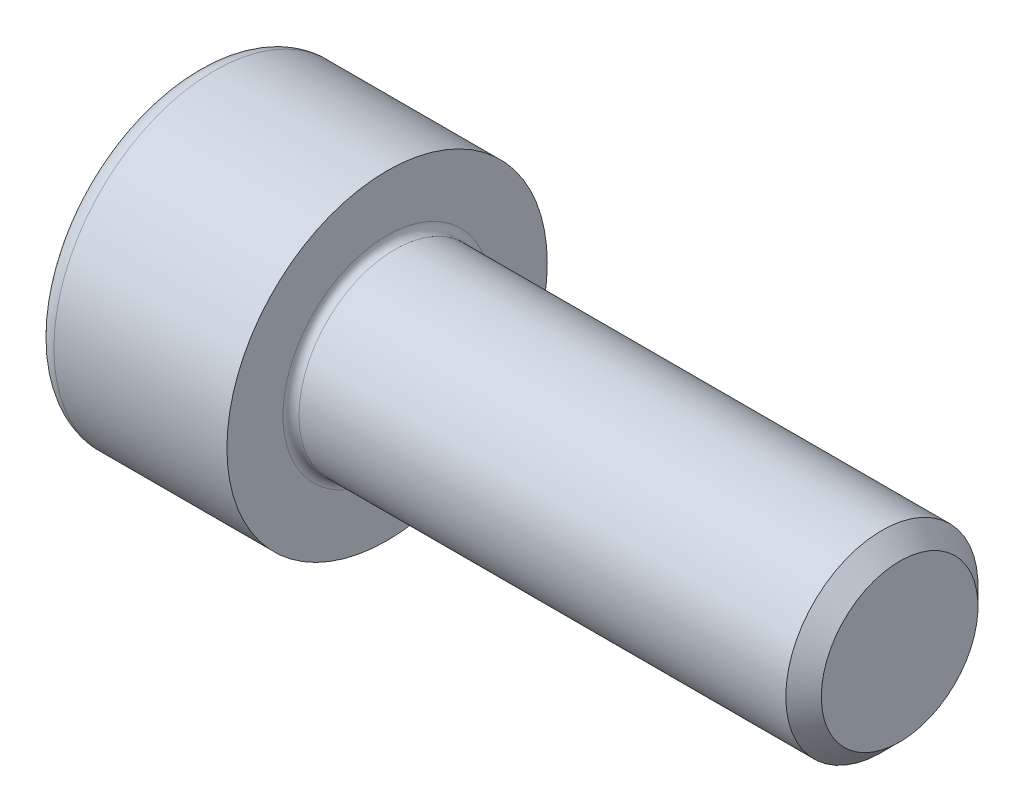
ISO-10303-21;
HEADER;
FILE_DESCRIPTION(('STEP AP214'),'2;1');
FILE_NAME('part.step','',(''),(''),'','','');
FILE_SCHEMA(('AUTOMOTIVE_DESIGN { 1 0 10303 214 1 1 1 1 }'));
ENDSEC;
DATA;
#1=APPLICATION_CONTEXT('core data for automotive mechanical design processes');
#2=APPLICATION_PROTOCOL_DEFINITION('international standard','automotive_design',2000,#1);
#3=PRODUCT_CONTEXT('',#1,'mechanical');
#4=PRODUCT('Part','Part','',(#3));
#5=PRODUCT_RELATED_PRODUCT_CATEGORY('part','',(#4));
#6=PRODUCT_DEFINITION_FORMATION('','',#4);
#7=PRODUCT_DEFINITION_CONTEXT('part definition',#1,'design');
#8=PRODUCT_DEFINITION('design','',#6,#7);
#9=PRODUCT_DEFINITION_SHAPE('','',#8);
#10=(LENGTH_UNIT() NAMED_UNIT(*) SI_UNIT(.MILLI.,.METRE.));
#11=(NAMED_UNIT(*) PLANE_ANGLE_UNIT() SI_UNIT($,.RADIAN.));
#12=(NAMED_UNIT(*) SI_UNIT($,.STERADIAN.) SOLID_ANGLE_UNIT());
#13=UNCERTAINTY_MEASURE_WITH_UNIT(LENGTH_MEASURE(1.E-05),#10,'distance_accuracy_value','');
#14=(GEOMETRIC_REPRESENTATION_CONTEXT(3) GLOBAL_UNCERTAINTY_ASSIGNED_CONTEXT((#13)) GLOBAL_UNIT_ASSIGNED_CONTEXT((#10,
#11,#12)) REPRESENTATION_CONTEXT('',''));
#15=CARTESIAN_POINT('',(0.,0.,0.));
#16=DIRECTION('',(0.,0.,1.));
#17=DIRECTION('',(1.,0.,0.));
#18=AXIS2_PLACEMENT_3D('',#15,#16,#17);
#19=CARTESIAN_POINT('',(0.,0.,0.));
#20=DIRECTION('',(-1.,0.,0.));
#21=DIRECTION('',(0.,0.,1.));
#22=AXIS2_PLACEMENT_3D('',#19,#20,#21);
#23=PLANE('',#22);
#24=DIRECTION('',(0.,-0.499999999999999,0.86602540378444));
#25=VECTOR('',#24,1.);
#26=CARTESIAN_POINT('',(0.,2.89829835133191,0.));
#27=LINE('',#26,#25);
#28=CARTESIAN_POINT('',(0.,2.89829835133191,0.));
#29=VERTEX_POINT('',#28);
#30=CARTESIAN_POINT('',(0.,1.44914917566596,2.51));
#31=VERTEX_POINT('',#30);
#32=EDGE_CURVE('E263',#29,#31,#27,.T.);
#33=ORIENTED_EDGE('',*,*,#32,.T.);
#34=DIRECTION('',(0.,1.,0.));
#35=VECTOR('',#34,1.);
#36=CARTESIAN_POINT('',(0.,-1.44914917566596,2.51));
#37=LINE('',#36,#35);
#38=CARTESIAN_POINT('',(0.,-1.44914917566596,2.51));
#39=VERTEX_POINT('',#38);
#40=EDGE_CURVE('E135',#39,#31,#37,.T.);
#41=ORIENTED_EDGE('',*,*,#40,.F.);
#42=DIRECTION('',(0.,-0.500000000000001,-0.866025403784438));
#43=VECTOR('',#42,1.);
#44=CARTESIAN_POINT('',(0.,-1.44914917566596,2.51));
#45=LINE('',#44,#43);
#46=CARTESIAN_POINT('',(0.,-2.89829835133192,0.));
#47=VERTEX_POINT('',#46);
#48=EDGE_CURVE('E266',#39,#47,#45,.T.);
#49=ORIENTED_EDGE('',*,*,#48,.T.);
#50=DIRECTION('',(0.,0.499999999999998,-0.866025403784439));
#51=VECTOR('',#50,1.);
#52=CARTESIAN_POINT('',(0.,-2.89829835133192,0.));
#53=LINE('',#52,#51);
#54=CARTESIAN_POINT('',(0.,-1.44914917566597,-2.51));
#55=VERTEX_POINT('',#54);
#56=EDGE_CURVE('E269',#47,#55,#53,.T.);
#57=ORIENTED_EDGE('',*,*,#56,.T.);
#58=DIRECTION('',(0.,-1.,0.));
#59=VECTOR('',#58,1.);
#60=CARTESIAN_POINT('',(0.,1.44914917566595,-2.51));
#61=LINE('',#60,#59);
#62=CARTESIAN_POINT('',(0.,1.44914917566595,-2.51));
#63=VERTEX_POINT('',#62);
#64=EDGE_CURVE('E272',#63,#55,#61,.T.);
#65=ORIENTED_EDGE('',*,*,#64,.F.);
#66=DIRECTION('',(0.,-0.500000000000001,-0.866025403784438));
#67=VECTOR('',#66,1.);
#68=CARTESIAN_POINT('',(0.,2.89829835133191,0.));
#69=LINE('',#68,#67);
#70=EDGE_CURVE('E130',#29,#63,#69,.T.);
#71=ORIENTED_EDGE('',*,*,#70,.F.);
#72=EDGE_LOOP('',(#33,#41,#49,#57,#65,#71));
#73=FACE_BOUND('',#72,.T.);
#74=CARTESIAN_POINT('',(0.,0.,0.));
#75=DIRECTION('',(-1.,0.,0.));
#76=DIRECTION('',(0.,0.,1.));
#77=AXIS2_PLACEMENT_3D('',#74,#75,#76);
#78=CIRCLE('',#77,4.4);
#79=CARTESIAN_POINT('',(0.,0.,4.4));
#80=VERTEX_POINT('',#79);
#81=EDGE_CURVE('E47',#80,#80,#78,.T.);
#82=ORIENTED_EDGE('',*,*,#81,.T.);
#83=EDGE_LOOP('',(#82));
#84=FACE_BOUND('',#83,.T.);
#85=ADVANCED_FACE('F39',(#73,#84),#23,.T.);
#86=CARTESIAN_POINT('',(-31.75,0.,0.));
#87=DIRECTION('',(-1.,0.,0.));
#88=DIRECTION('',(0.,0.,1.));
#89=AXIS2_PLACEMENT_3D('',#86,#87,#88);
#90=CYLINDRICAL_SURFACE('',#89,5.);
#91=CARTESIAN_POINT('',(0.600000000000003,0.,0.));
#92=DIRECTION('',(-1.,0.,0.));
#93=DIRECTION('',(0.,0.,1.));
#94=AXIS2_PLACEMENT_3D('',#91,#92,#93);
#95=CIRCLE('',#94,5.);
#96=CARTESIAN_POINT('',(0.600000000000003,0.,5.));
#97=VERTEX_POINT('',#96);
#98=EDGE_CURVE('E11',#97,#97,#95,.F.);
#99=ORIENTED_EDGE('',*,*,#98,.T.);
#100=EDGE_LOOP('',(#99));
#101=FACE_BOUND('',#100,.T.);
#102=CARTESIAN_POINT('',(6.,0.,0.));
#103=DIRECTION('',(-1.,0.,0.));
#104=DIRECTION('',(0.,0.,1.));
#105=AXIS2_PLACEMENT_3D('',#102,#103,#104);
#106=CIRCLE('',#105,5.);
#107=CARTESIAN_POINT('',(6.,0.,5.));
#108=VERTEX_POINT('',#107);
#109=EDGE_CURVE('E153',#108,#108,#106,.T.);
#110=ORIENTED_EDGE('',*,*,#109,.T.);
#111=EDGE_LOOP('',(#110));
#112=FACE_BOUND('',#111,.T.);
#113=ADVANCED_FACE('F177',(#101,#112),#90,.T.);
#114=CARTESIAN_POINT('',(6.,5.,0.));
#115=DIRECTION('',(1.,0.,0.));
#116=DIRECTION('',(0.,0.,-1.));
#117=AXIS2_PLACEMENT_3D('',#114,#115,#116);
#118=PLANE('',#117);
#119=CARTESIAN_POINT('',(6.,0.,0.));
#120=DIRECTION('',(1.,0.,0.));
#121=DIRECTION('',(0.,0.,-1.));
#122=AXIS2_PLACEMENT_3D('',#119,#120,#121);
#123=CIRCLE('',#122,3.24999999999999);
#124=CARTESIAN_POINT('',(6.,0.,-3.24999999999999));
#125=VERTEX_POINT('',#124);
#126=EDGE_CURVE('E156',#125,#125,#123,.F.);
#127=ORIENTED_EDGE('',*,*,#126,.T.);
#128=EDGE_LOOP('',(#127));
#129=FACE_BOUND('',#128,.T.);
#130=ORIENTED_EDGE('',*,*,#109,.F.);
#131=EDGE_LOOP('',(#130));
#132=FACE_BOUND('',#131,.T.);
#133=ADVANCED_FACE('F183',(#129,#132),#118,.T.);
#134=CARTESIAN_POINT('',(-31.75,0.,0.));
#135=DIRECTION('',(-1.,0.,0.));
#136=DIRECTION('',(0.,0.,1.));
#137=AXIS2_PLACEMENT_3D('',#134,#135,#136);
#138=CYLINDRICAL_SURFACE('',#137,2.99999999999999);
#139=CARTESIAN_POINT('',(6.25,0.,0.));
#140=DIRECTION('',(1.,0.,0.));
#141=DIRECTION('',(0.,0.,-1.));
#142=AXIS2_PLACEMENT_3D('',#139,#140,#141);
#143=CIRCLE('',#142,2.99999999999999);
#144=CARTESIAN_POINT('',(6.25,0.,-2.99999999999999));
#145=VERTEX_POINT('',#144);
#146=EDGE_CURVE('E159',#145,#145,#143,.T.);
#147=ORIENTED_EDGE('',*,*,#146,.T.);
#148=EDGE_LOOP('',(#147));
#149=FACE_BOUND('',#148,.T.);
#150=CARTESIAN_POINT('',(21.4455,0.,0.));
#151=DIRECTION('',(-1.,0.,0.));
#152=DIRECTION('',(0.,0.,1.));
#153=AXIS2_PLACEMENT_3D('',#150,#151,#152);
#154=CIRCLE('',#153,2.99999999999998);
#155=CARTESIAN_POINT('',(21.4455,0.,2.99999999999998));
#156=VERTEX_POINT('',#155);
#157=EDGE_CURVE('E150',#156,#156,#154,.T.);
#158=ORIENTED_EDGE('',*,*,#157,.T.);
#159=EDGE_LOOP('',(#158));
#160=FACE_BOUND('',#159,.T.);
#161=ADVANCED_FACE('F189',(#149,#160),#138,.T.);
#162=CARTESIAN_POINT('',(22.,0.,0.));
#163=DIRECTION('',(-1.,0.,0.));
#164=DIRECTION('',(0.,0.,1.));
#165=AXIS2_PLACEMENT_3D('',#162,#163,#164);
#166=CONICAL_SURFACE('',#165,2.4455,0.785398163397408);
#167=ORIENTED_EDGE('',*,*,#157,.F.);
#168=EDGE_LOOP('',(#167));
#169=FACE_BOUND('',#168,.T.);
#170=CARTESIAN_POINT('',(22.,0.,0.));
#171=DIRECTION('',(-1.,0.,0.));
#172=DIRECTION('',(0.,0.,1.));
#173=AXIS2_PLACEMENT_3D('',#170,#171,#172);
#174=CIRCLE('',#173,2.4455);
#175=CARTESIAN_POINT('',(22.,0.,2.4455));
#176=VERTEX_POINT('',#175);
#177=EDGE_CURVE('E146',#176,#176,#174,.T.);
#178=ORIENTED_EDGE('',*,*,#177,.T.);
#179=EDGE_LOOP('',(#178));
#180=FACE_BOUND('',#179,.T.);
#181=ADVANCED_FACE('F193',(#169,#180),#166,.T.);
#182=CARTESIAN_POINT('',(22.,2.4455,0.));
#183=DIRECTION('',(1.,0.,0.));
#184=DIRECTION('',(0.,0.,-1.));
#185=AXIS2_PLACEMENT_3D('',#182,#183,#184);
#186=PLANE('',#185);
#187=ORIENTED_EDGE('',*,*,#177,.F.);
#188=EDGE_LOOP('',(#187));
#189=FACE_BOUND('',#188,.T.);
#190=ADVANCED_FACE('F173',(#189),#186,.T.);
#191=CARTESIAN_POINT('',(6.25,0.,0.));
#192=DIRECTION('',(1.,0.,0.));
#193=DIRECTION('',(0.,0.,-1.));
#194=AXIS2_PLACEMENT_3D('',#191,#192,#193);
#195=TOROIDAL_SURFACE('',#194,3.24999999999999,0.25);
#196=ORIENTED_EDGE('',*,*,#146,.F.);
#197=EDGE_LOOP('',(#196));
#198=FACE_BOUND('',#197,.T.);
#199=ORIENTED_EDGE('',*,*,#126,.F.);
#200=EDGE_LOOP('',(#199));
#201=FACE_BOUND('',#200,.T.);
#202=ADVANCED_FACE('F166',(#198,#201),#195,.F.);
#203=CARTESIAN_POINT('',(0.600000000000003,0.,0.));
#204=DIRECTION('',(-1.,0.,0.));
#205=DIRECTION('',(0.,0.,1.));
#206=AXIS2_PLACEMENT_3D('',#203,#204,#205);
#207=TOROIDAL_SURFACE('',#206,4.4,0.6);
#208=ORIENTED_EDGE('',*,*,#98,.F.);
#209=EDGE_LOOP('',(#208));
#210=FACE_BOUND('',#209,.T.);
#211=ORIENTED_EDGE('',*,*,#81,.F.);
#212=EDGE_LOOP('',(#211));
#213=FACE_BOUND('',#212,.T.);
#214=ADVANCED_FACE('F41',(#210,#213),#207,.T.);
#215=CARTESIAN_POINT('',(3.,2.89829835133191,0.));
#216=DIRECTION('',(0.,-0.866025403784439,-0.499999999999998));
#217=DIRECTION('',(0.,0.499999999999999,-0.86602540378444));
#218=AXIS2_PLACEMENT_3D('',#215,#216,#217);
#219=PLANE('',#218);
#220=ORIENTED_EDGE('',*,*,#32,.F.);
#221=DIRECTION('',(-1.,0.,0.));
#222=VECTOR('',#221,1.);
#223=CARTESIAN_POINT('',(3.,2.89829835133191,0.));
#224=LINE('',#223,#222);
#225=CARTESIAN_POINT('',(3.,2.89829835133191,0.));
#226=VERTEX_POINT('',#225);
#227=EDGE_CURVE('E253',#226,#29,#224,.T.);
#228=ORIENTED_EDGE('',*,*,#227,.F.);
#229=DIRECTION('',(0.,-0.499999999999999,0.86602540378444));
#230=VECTOR('',#229,1.);
#231=CARTESIAN_POINT('',(3.,2.89829835133191,0.));
#232=LINE('',#231,#230);
#233=CARTESIAN_POINT('',(3.,2.17372376349894,1.25499999999999));
#234=VERTEX_POINT('',#233);
#235=EDGE_CURVE('E122',#226,#234,#232,.T.);
#236=ORIENTED_EDGE('',*,*,#235,.T.);
#237=CARTESIAN_POINT('',(3.,1.44914917566596,2.51));
#238=VERTEX_POINT('',#237);
#239=EDGE_CURVE('E113',#234,#238,#232,.T.);
#240=ORIENTED_EDGE('',*,*,#239,.T.);
#241=DIRECTION('',(-1.,0.,0.));
#242=VECTOR('',#241,1.);
#243=CARTESIAN_POINT('',(3.,1.44914917566596,2.51));
#244=LINE('',#243,#242);
#245=EDGE_CURVE('E127',#238,#31,#244,.T.);
#246=ORIENTED_EDGE('',*,*,#245,.T.);
#247=EDGE_LOOP('',(#220,#228,#236,#240,#246));
#248=FACE_BOUND('',#247,.T.);
#249=ADVANCED_FACE('F126',(#248),#219,.T.);
#250=CARTESIAN_POINT('',(3.,-1.44914917566596,2.51));
#251=DIRECTION('',(0.,0.,1.));
#252=DIRECTION('',(0.,-1.,0.));
#253=AXIS2_PLACEMENT_3D('',#250,#251,#252);
#254=PLANE('',#253);
#255=ORIENTED_EDGE('',*,*,#40,.T.);
#256=ORIENTED_EDGE('',*,*,#245,.F.);
#257=DIRECTION('',(0.,1.,0.));
#258=VECTOR('',#257,1.);
#259=CARTESIAN_POINT('',(3.,-1.44914917566596,2.51));
#260=LINE('',#259,#258);
#261=CARTESIAN_POINT('',(3.,0.,2.51));
#262=VERTEX_POINT('',#261);
#263=EDGE_CURVE('E110',#262,#238,#260,.T.);
#264=ORIENTED_EDGE('',*,*,#263,.F.);
#265=CARTESIAN_POINT('',(3.,-1.44914917566596,2.51));
#266=VERTEX_POINT('',#265);
#267=EDGE_CURVE('E121',#266,#262,#260,.T.);
#268=ORIENTED_EDGE('',*,*,#267,.F.);
#269=DIRECTION('',(-1.,0.,0.));
#270=VECTOR('',#269,1.);
#271=CARTESIAN_POINT('',(3.,-1.44914917566596,2.51));
#272=LINE('',#271,#270);
#273=EDGE_CURVE('E137',#266,#39,#272,.T.);
#274=ORIENTED_EDGE('',*,*,#273,.T.);
#275=EDGE_LOOP('',(#255,#256,#264,#268,#274));
#276=FACE_BOUND('',#275,.T.);
#277=ADVANCED_FACE('F132',(#276),#254,.F.);
#278=CARTESIAN_POINT('',(3.,-1.44914917566596,2.51));
#279=DIRECTION('',(0.,0.866025403784438,-0.500000000000001));
#280=DIRECTION('',(0.,0.500000000000001,0.866025403784438));
#281=AXIS2_PLACEMENT_3D('',#278,#279,#280);
#282=PLANE('',#281);
#283=ORIENTED_EDGE('',*,*,#48,.F.);
#284=ORIENTED_EDGE('',*,*,#273,.F.);
#285=DIRECTION('',(0.,-0.500000000000001,-0.866025403784438));
#286=VECTOR('',#285,1.);
#287=CARTESIAN_POINT('',(3.,-1.44914917566596,2.51));
#288=LINE('',#287,#286);
#289=CARTESIAN_POINT('',(3.,-2.17372376349894,1.255));
#290=VERTEX_POINT('',#289);
#291=EDGE_CURVE('E292',#266,#290,#288,.T.);
#292=ORIENTED_EDGE('',*,*,#291,.T.);
#293=CARTESIAN_POINT('',(3.,-2.89829835133192,0.));
#294=VERTEX_POINT('',#293);
#295=EDGE_CURVE('E281',#290,#294,#288,.T.);
#296=ORIENTED_EDGE('',*,*,#295,.T.);
#297=DIRECTION('',(-1.,0.,0.));
#298=VECTOR('',#297,1.);
#299=CARTESIAN_POINT('',(3.,-2.89829835133192,0.));
#300=LINE('',#299,#298);
#301=EDGE_CURVE('E142',#294,#47,#300,.T.);
#302=ORIENTED_EDGE('',*,*,#301,.T.);
#303=EDGE_LOOP('',(#283,#284,#292,#296,#302));
#304=FACE_BOUND('',#303,.T.);
#305=ADVANCED_FACE('F207',(#304),#282,.T.);
#306=CARTESIAN_POINT('',(3.,-2.89829835133192,0.));
#307=DIRECTION('',(0.,0.86602540378444,0.499999999999998));
#308=DIRECTION('',(0.,-0.499999999999998,0.86602540378444));
#309=AXIS2_PLACEMENT_3D('',#306,#307,#308);
#310=PLANE('',#309);
#311=ORIENTED_EDGE('',*,*,#56,.F.);
#312=ORIENTED_EDGE('',*,*,#301,.F.);
#313=DIRECTION('',(0.,0.499999999999998,-0.866025403784439));
#314=VECTOR('',#313,1.);
#315=CARTESIAN_POINT('',(3.,-2.89829835133192,0.));
#316=LINE('',#315,#314);
#317=CARTESIAN_POINT('',(3.,-2.17372376349895,-1.255));
#318=VERTEX_POINT('',#317);
#319=EDGE_CURVE('E259',#294,#318,#316,.T.);
#320=ORIENTED_EDGE('',*,*,#319,.T.);
#321=CARTESIAN_POINT('',(3.,-1.44914917566597,-2.51));
#322=VERTEX_POINT('',#321);
#323=EDGE_CURVE('E291',#318,#322,#316,.T.);
#324=ORIENTED_EDGE('',*,*,#323,.T.);
#325=DIRECTION('',(-1.,0.,0.));
#326=VECTOR('',#325,1.);
#327=CARTESIAN_POINT('',(3.,-1.44914917566597,-2.51));
#328=LINE('',#327,#326);
#329=EDGE_CURVE('E252',#322,#55,#328,.T.);
#330=ORIENTED_EDGE('',*,*,#329,.T.);
#331=EDGE_LOOP('',(#311,#312,#320,#324,#330));
#332=FACE_BOUND('',#331,.T.);
#333=ADVANCED_FACE('F210',(#332),#310,.T.);
#334=CARTESIAN_POINT('',(3.,1.44914917566595,-2.51));
#335=DIRECTION('',(0.,0.,-1.));
#336=DIRECTION('',(0.,1.,0.));
#337=AXIS2_PLACEMENT_3D('',#334,#335,#336);
#338=PLANE('',#337);
#339=ORIENTED_EDGE('',*,*,#64,.T.);
#340=ORIENTED_EDGE('',*,*,#329,.F.);
#341=DIRECTION('',(0.,-1.,0.));
#342=VECTOR('',#341,1.);
#343=CARTESIAN_POINT('',(3.,1.44914917566595,-2.51));
#344=LINE('',#343,#342);
#345=CARTESIAN_POINT('',(3.,0.,-2.51));
#346=VERTEX_POINT('',#345);
#347=EDGE_CURVE('E256',#346,#322,#344,.T.);
#348=ORIENTED_EDGE('',*,*,#347,.F.);
#349=CARTESIAN_POINT('',(3.,1.44914917566595,-2.51));
#350=VERTEX_POINT('',#349);
#351=EDGE_CURVE('E54',#350,#346,#344,.T.);
#352=ORIENTED_EDGE('',*,*,#351,.F.);
#353=DIRECTION('',(-1.,0.,0.));
#354=VECTOR('',#353,1.);
#355=CARTESIAN_POINT('',(3.,1.44914917566595,-2.51));
#356=LINE('',#355,#354);
#357=EDGE_CURVE('E249',#350,#63,#356,.T.);
#358=ORIENTED_EDGE('',*,*,#357,.T.);
#359=EDGE_LOOP('',(#339,#340,#348,#352,#358));
#360=FACE_BOUND('',#359,.T.);
#361=ADVANCED_FACE('F214',(#360),#338,.F.);
#362=CARTESIAN_POINT('',(3.,2.89829835133191,0.));
#363=DIRECTION('',(0.,0.866025403784438,-0.500000000000001));
#364=DIRECTION('',(0.,0.500000000000001,0.866025403784438));
#365=AXIS2_PLACEMENT_3D('',#362,#363,#364);
#366=PLANE('',#365);
#367=ORIENTED_EDGE('',*,*,#70,.T.);
#368=ORIENTED_EDGE('',*,*,#357,.F.);
#369=DIRECTION('',(0.,-0.500000000000001,-0.866025403784438));
#370=VECTOR('',#369,1.);
#371=CARTESIAN_POINT('',(3.,2.89829835133191,0.));
#372=LINE('',#371,#370);
#373=CARTESIAN_POINT('',(3.,2.17372376349894,-1.255));
#374=VERTEX_POINT('',#373);
#375=EDGE_CURVE('E239',#374,#350,#372,.T.);
#376=ORIENTED_EDGE('',*,*,#375,.F.);
#377=EDGE_CURVE('E245',#226,#374,#372,.T.);
#378=ORIENTED_EDGE('',*,*,#377,.F.);
#379=ORIENTED_EDGE('',*,*,#227,.T.);
#380=EDGE_LOOP('',(#367,#368,#376,#378,#379));
#381=FACE_BOUND('',#380,.T.);
#382=ADVANCED_FACE('F218',(#381),#366,.F.);
#383=CARTESIAN_POINT('',(3.,4.34744752699787,-2.51000000000001));
#384=DIRECTION('',(1.,0.,0.));
#385=DIRECTION('',(0.,0.,-1.));
#386=AXIS2_PLACEMENT_3D('',#383,#384,#385);
#387=PLANE('',#386);
#388=ORIENTED_EDGE('',*,*,#347,.T.);
#389=ORIENTED_EDGE('',*,*,#323,.F.);
#390=CARTESIAN_POINT('',(3.,0.,0.));
#391=DIRECTION('',(-1.,0.,0.));
#392=DIRECTION('',(0.,0.,1.));
#393=AXIS2_PLACEMENT_3D('',#390,#391,#392);
#394=CIRCLE('',#393,2.51);
#395=EDGE_CURVE('E287',#346,#318,#394,.T.);
#396=ORIENTED_EDGE('',*,*,#395,.F.);
#397=EDGE_LOOP('',(#388,#389,#396));
#398=FACE_BOUND('',#397,.T.);
#399=ADVANCED_FACE('F222',(#398),#387,.F.);
#400=ORIENTED_EDGE('',*,*,#319,.F.);
#401=ORIENTED_EDGE('',*,*,#295,.F.);
#402=EDGE_CURVE('E140',#318,#290,#394,.T.);
#403=ORIENTED_EDGE('',*,*,#402,.F.);
#404=EDGE_LOOP('',(#400,#401,#403));
#405=FACE_BOUND('',#404,.T.);
#406=ADVANCED_FACE('F225',(#405),#387,.F.);
#407=ORIENTED_EDGE('',*,*,#291,.F.);
#408=ORIENTED_EDGE('',*,*,#267,.T.);
#409=EDGE_CURVE('E136',#290,#262,#394,.T.);
#410=ORIENTED_EDGE('',*,*,#409,.F.);
#411=EDGE_LOOP('',(#407,#408,#410));
#412=FACE_BOUND('',#411,.T.);
#413=ADVANCED_FACE('F230',(#412),#387,.F.);
#414=ORIENTED_EDGE('',*,*,#263,.T.);
#415=ORIENTED_EDGE('',*,*,#239,.F.);
#416=EDGE_CURVE('E116',#262,#234,#394,.T.);
#417=ORIENTED_EDGE('',*,*,#416,.F.);
#418=EDGE_LOOP('',(#414,#415,#417));
#419=FACE_BOUND('',#418,.T.);
#420=ADVANCED_FACE('F112',(#419),#387,.F.);
#421=ORIENTED_EDGE('',*,*,#235,.F.);
#422=ORIENTED_EDGE('',*,*,#377,.T.);
#423=EDGE_CURVE('E147',#234,#374,#394,.T.);
#424=ORIENTED_EDGE('',*,*,#423,.F.);
#425=EDGE_LOOP('',(#421,#422,#424));
#426=FACE_BOUND('',#425,.T.);
#427=ADVANCED_FACE('F233',(#426),#387,.F.);
#428=ORIENTED_EDGE('',*,*,#375,.T.);
#429=ORIENTED_EDGE('',*,*,#351,.T.);
#430=EDGE_CURVE('E242',#374,#346,#394,.T.);
#431=ORIENTED_EDGE('',*,*,#430,.F.);
#432=EDGE_LOOP('',(#428,#429,#431));
#433=FACE_BOUND('',#432,.T.);
#434=ADVANCED_FACE('F203',(#433),#387,.F.);
#435=CARTESIAN_POINT('',(3.,0.,0.));
#436=DIRECTION('',(-1.,0.,0.));
#437=DIRECTION('',(0.,0.,1.));
#438=AXIS2_PLACEMENT_3D('',#435,#436,#437);
#439=CONICAL_SURFACE('',#438,2.51,1.04719755119659);
#440=CARTESIAN_POINT('',(4.44914917566598,0.,0.));
#441=VERTEX_POINT('',#440);
#442=VERTEX_LOOP('',#441);
#443=FACE_BOUND('',#442,.T.);
#444=ORIENTED_EDGE('',*,*,#416,.T.);
#445=ORIENTED_EDGE('',*,*,#423,.T.);
#446=ORIENTED_EDGE('',*,*,#430,.T.);
#447=ORIENTED_EDGE('',*,*,#395,.T.);
#448=ORIENTED_EDGE('',*,*,#402,.T.);
#449=ORIENTED_EDGE('',*,*,#409,.T.);
#450=EDGE_LOOP('',(#444,#445,#446,#447,#448,#449));
#451=FACE_BOUND('',#450,.T.);
#452=ADVANCED_FACE('F201',(#443,#451),#439,.F.);
#453=CLOSED_SHELL('',(#85,#113,#133,#161,#181,#190,#202,#214,#249,#277,#305,#333,#361,#382,#399,
#406,#413,#420,#427,#434,#452));
#454=MANIFOLD_SOLID_BREP('B2',#453);
#455=ADVANCED_BREP_SHAPE_REPRESENTATION('',(#18,#454),#14);
#456=SHAPE_DEFINITION_REPRESENTATION(#9,#455);
ENDSEC;
END-ISO-10303-21;
